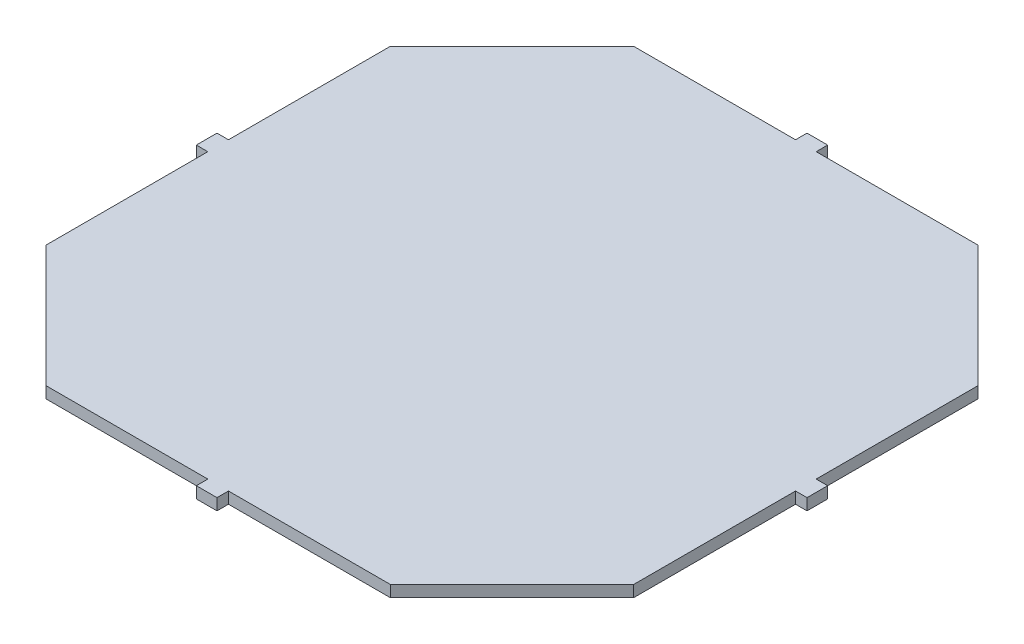
ISO-10303-21;
HEADER;
FILE_DESCRIPTION(('STEP AP214'),'2;1');
FILE_NAME('part.step','',(''),(''),'','','');
FILE_SCHEMA(('AUTOMOTIVE_DESIGN { 1 0 10303 214 1 1 1 1 }'));
ENDSEC;
DATA;
#1=APPLICATION_CONTEXT('core data for automotive mechanical design processes');
#2=APPLICATION_PROTOCOL_DEFINITION('international standard','automotive_design',2000,#1);
#3=PRODUCT_CONTEXT('',#1,'mechanical');
#4=PRODUCT('Part','Part','',(#3));
#5=PRODUCT_RELATED_PRODUCT_CATEGORY('part','',(#4));
#6=PRODUCT_DEFINITION_FORMATION('','',#4);
#7=PRODUCT_DEFINITION_CONTEXT('part definition',#1,'design');
#8=PRODUCT_DEFINITION('design','',#6,#7);
#9=PRODUCT_DEFINITION_SHAPE('','',#8);
#10=(LENGTH_UNIT() NAMED_UNIT(*) SI_UNIT(.MILLI.,.METRE.));
#11=(NAMED_UNIT(*) PLANE_ANGLE_UNIT() SI_UNIT($,.RADIAN.));
#12=(NAMED_UNIT(*) SI_UNIT($,.STERADIAN.) SOLID_ANGLE_UNIT());
#13=UNCERTAINTY_MEASURE_WITH_UNIT(LENGTH_MEASURE(1.E-05),#10,'distance_accuracy_value','');
#14=(GEOMETRIC_REPRESENTATION_CONTEXT(3) GLOBAL_UNCERTAINTY_ASSIGNED_CONTEXT((#13)) GLOBAL_UNIT_ASSIGNED_CONTEXT((#10,
#11,#12)) REPRESENTATION_CONTEXT('',''));
#15=CARTESIAN_POINT('',(0.,0.,0.));
#16=DIRECTION('',(0.,0.,1.));
#17=DIRECTION('',(1.,0.,0.));
#18=AXIS2_PLACEMENT_3D('',#15,#16,#17);
#19=CARTESIAN_POINT('',(25.6066017177982,1.,15.));
#20=DIRECTION('',(-1.,0.,0.));
#21=DIRECTION('',(0.,0.,1.));
#22=AXIS2_PLACEMENT_3D('',#19,#20,#21);
#23=PLANE('',#22);
#24=DIRECTION('',(0.,1.,0.));
#25=VECTOR('',#24,1.);
#26=CARTESIAN_POINT('',(25.6066017177982,0.,-0.899999999999994));
#27=LINE('',#26,#25);
#28=CARTESIAN_POINT('',(25.6066017177982,0.,-0.899999999999994));
#29=VERTEX_POINT('',#28);
#30=CARTESIAN_POINT('',(25.6066017177982,1.,-0.899999999999994));
#31=VERTEX_POINT('',#30);
#32=EDGE_CURVE('E212',#29,#31,#27,.T.);
#33=ORIENTED_EDGE('',*,*,#32,.F.);
#34=DIRECTION('',(0.,0.,-1.));
#35=VECTOR('',#34,1.);
#36=CARTESIAN_POINT('',(25.6066017177982,0.,15.));
#37=LINE('',#36,#35);
#38=CARTESIAN_POINT('',(25.6066017177982,0.,-15.));
#39=VERTEX_POINT('',#38);
#40=EDGE_CURVE('E224',#29,#39,#37,.T.);
#41=ORIENTED_EDGE('',*,*,#40,.T.);
#42=DIRECTION('',(0.,-1.,0.));
#43=VECTOR('',#42,1.);
#44=CARTESIAN_POINT('',(25.6066017177982,1.,-15.));
#45=LINE('',#44,#43);
#46=CARTESIAN_POINT('',(25.6066017177982,1.,-15.));
#47=VERTEX_POINT('',#46);
#48=EDGE_CURVE('E428',#47,#39,#45,.T.);
#49=ORIENTED_EDGE('',*,*,#48,.F.);
#50=DIRECTION('',(0.,0.,-1.));
#51=VECTOR('',#50,1.);
#52=CARTESIAN_POINT('',(25.6066017177982,1.,15.));
#53=LINE('',#52,#51);
#54=EDGE_CURVE('E370',#31,#47,#53,.T.);
#55=ORIENTED_EDGE('',*,*,#54,.F.);
#56=EDGE_LOOP('',(#33,#41,#49,#55));
#57=FACE_BOUND('',#56,.T.);
#58=ADVANCED_FACE('F39',(#57),#23,.F.);
#59=CARTESIAN_POINT('',(-15.,1.,25.6066017177983));
#60=DIRECTION('',(0.,0.,-1.));
#61=DIRECTION('',(-1.,0.,0.));
#62=AXIS2_PLACEMENT_3D('',#59,#60,#61);
#63=PLANE('',#62);
#64=DIRECTION('',(0.,1.,0.));
#65=VECTOR('',#64,1.);
#66=CARTESIAN_POINT('',(0.9,0.,25.6066017177983));
#67=LINE('',#66,#65);
#68=CARTESIAN_POINT('',(0.9,0.,25.6066017177983));
#69=VERTEX_POINT('',#68);
#70=CARTESIAN_POINT('',(0.9,1.,25.6066017177983));
#71=VERTEX_POINT('',#70);
#72=EDGE_CURVE('E277',#69,#71,#67,.T.);
#73=ORIENTED_EDGE('',*,*,#72,.F.);
#74=DIRECTION('',(1.,0.,0.));
#75=VECTOR('',#74,1.);
#76=CARTESIAN_POINT('',(-15.,0.,25.6066017177983));
#77=LINE('',#76,#75);
#78=CARTESIAN_POINT('',(15.,0.,25.6066017177983));
#79=VERTEX_POINT('',#78);
#80=EDGE_CURVE('E394',#69,#79,#77,.T.);
#81=ORIENTED_EDGE('',*,*,#80,.T.);
#82=DIRECTION('',(0.,-1.,0.));
#83=VECTOR('',#82,1.);
#84=CARTESIAN_POINT('',(15.,1.,25.6066017177983));
#85=LINE('',#84,#83);
#86=CARTESIAN_POINT('',(15.,1.,25.6066017177983));
#87=VERTEX_POINT('',#86);
#88=EDGE_CURVE('E436',#87,#79,#85,.T.);
#89=ORIENTED_EDGE('',*,*,#88,.F.);
#90=DIRECTION('',(1.,0.,0.));
#91=VECTOR('',#90,1.);
#92=CARTESIAN_POINT('',(-15.,1.,25.6066017177983));
#93=LINE('',#92,#91);
#94=EDGE_CURVE('E362',#71,#87,#93,.T.);
#95=ORIENTED_EDGE('',*,*,#94,.F.);
#96=EDGE_LOOP('',(#73,#81,#89,#95));
#97=FACE_BOUND('',#96,.T.);
#98=ADVANCED_FACE('F532',(#97),#63,.F.);
#99=CARTESIAN_POINT('',(-15.,1.,-25.6066017177983));
#100=DIRECTION('',(0.,0.,1.));
#101=DIRECTION('',(1.,0.,0.));
#102=AXIS2_PLACEMENT_3D('',#99,#100,#101);
#103=PLANE('',#102);
#104=DIRECTION('',(0.,1.,0.));
#105=VECTOR('',#104,1.);
#106=CARTESIAN_POINT('',(-0.9,0.,-25.6066017177983));
#107=LINE('',#106,#105);
#108=CARTESIAN_POINT('',(-0.9,0.,-25.6066017177983));
#109=VERTEX_POINT('',#108);
#110=CARTESIAN_POINT('',(-0.9,1.,-25.6066017177983));
#111=VERTEX_POINT('',#110);
#112=EDGE_CURVE('E305',#109,#111,#107,.T.);
#113=ORIENTED_EDGE('',*,*,#112,.F.);
#114=DIRECTION('',(-1.,0.,0.));
#115=VECTOR('',#114,1.);
#116=CARTESIAN_POINT('',(-15.,0.,-25.6066017177983));
#117=LINE('',#116,#115);
#118=CARTESIAN_POINT('',(-15.,0.,-25.6066017177983));
#119=VERTEX_POINT('',#118);
#120=EDGE_CURVE('E409',#109,#119,#117,.T.);
#121=ORIENTED_EDGE('',*,*,#120,.T.);
#122=DIRECTION('',(0.,-1.,0.));
#123=VECTOR('',#122,1.);
#124=CARTESIAN_POINT('',(-15.,1.,-25.6066017177983));
#125=LINE('',#124,#123);
#126=CARTESIAN_POINT('',(-15.,1.,-25.6066017177983));
#127=VERTEX_POINT('',#126);
#128=EDGE_CURVE('E420',#127,#119,#125,.T.);
#129=ORIENTED_EDGE('',*,*,#128,.F.);
#130=DIRECTION('',(-1.,0.,0.));
#131=VECTOR('',#130,1.);
#132=CARTESIAN_POINT('',(-15.,1.,-25.6066017177983));
#133=LINE('',#132,#131);
#134=EDGE_CURVE('E378',#111,#127,#133,.T.);
#135=ORIENTED_EDGE('',*,*,#134,.F.);
#136=EDGE_LOOP('',(#113,#121,#129,#135));
#137=FACE_BOUND('',#136,.T.);
#138=ADVANCED_FACE('F479',(#137),#103,.F.);
#139=CARTESIAN_POINT('',(-25.6066017177982,1.,15.));
#140=DIRECTION('',(1.,0.,0.));
#141=DIRECTION('',(0.,0.,-1.));
#142=AXIS2_PLACEMENT_3D('',#139,#140,#141);
#143=PLANE('',#142);
#144=DIRECTION('',(0.,1.,0.));
#145=VECTOR('',#144,1.);
#146=CARTESIAN_POINT('',(-25.6066017177982,0.,0.9));
#147=LINE('',#146,#145);
#148=CARTESIAN_POINT('',(-25.6066017177982,0.,0.9));
#149=VERTEX_POINT('',#148);
#150=CARTESIAN_POINT('',(-25.6066017177982,1.,0.9));
#151=VERTEX_POINT('',#150);
#152=EDGE_CURVE('E341',#149,#151,#147,.T.);
#153=ORIENTED_EDGE('',*,*,#152,.F.);
#154=DIRECTION('',(0.,0.,1.));
#155=VECTOR('',#154,1.);
#156=CARTESIAN_POINT('',(-25.6066017177982,0.,15.));
#157=LINE('',#156,#155);
#158=CARTESIAN_POINT('',(-25.6066017177982,0.,15.));
#159=VERTEX_POINT('',#158);
#160=EDGE_CURVE('E344',#149,#159,#157,.T.);
#161=ORIENTED_EDGE('',*,*,#160,.T.);
#162=DIRECTION('',(0.,-1.,0.));
#163=VECTOR('',#162,1.);
#164=CARTESIAN_POINT('',(-25.6066017177982,1.,15.));
#165=LINE('',#164,#163);
#166=CARTESIAN_POINT('',(-25.6066017177982,1.,15.));
#167=VERTEX_POINT('',#166);
#168=EDGE_CURVE('E11',#167,#159,#165,.T.);
#169=ORIENTED_EDGE('',*,*,#168,.F.);
#170=DIRECTION('',(0.,0.,1.));
#171=VECTOR('',#170,1.);
#172=CARTESIAN_POINT('',(-25.6066017177982,1.,15.));
#173=LINE('',#172,#171);
#174=EDGE_CURVE('E359',#151,#167,#173,.T.);
#175=ORIENTED_EDGE('',*,*,#174,.F.);
#176=EDGE_LOOP('',(#153,#161,#169,#175));
#177=FACE_BOUND('',#176,.T.);
#178=ADVANCED_FACE('F462',(#177),#143,.F.);
#179=CARTESIAN_POINT('',(-25.6066017177982,0.,-15.));
#180=VERTEX_POINT('',#179);
#181=CARTESIAN_POINT('',(-25.6066017177982,0.,-0.9));
#182=VERTEX_POINT('',#181);
#183=EDGE_CURVE('E387',#180,#182,#157,.T.);
#184=ORIENTED_EDGE('',*,*,#183,.T.);
#185=DIRECTION('',(0.,1.,0.));
#186=VECTOR('',#185,1.);
#187=CARTESIAN_POINT('',(-25.6066017177982,0.,-0.9));
#188=LINE('',#187,#186);
#189=CARTESIAN_POINT('',(-25.6066017177982,1.,-0.900000000000001));
#190=VERTEX_POINT('',#189);
#191=EDGE_CURVE('E330',#182,#190,#188,.T.);
#192=ORIENTED_EDGE('',*,*,#191,.T.);
#193=CARTESIAN_POINT('',(-25.6066017177982,1.,-15.));
#194=VERTEX_POINT('',#193);
#195=EDGE_CURVE('E354',#194,#190,#173,.T.);
#196=ORIENTED_EDGE('',*,*,#195,.F.);
#197=DIRECTION('',(0.,-1.,0.));
#198=VECTOR('',#197,1.);
#199=CARTESIAN_POINT('',(-25.6066017177982,1.,-15.));
#200=LINE('',#199,#198);
#201=EDGE_CURVE('E386',#194,#180,#200,.T.);
#202=ORIENTED_EDGE('',*,*,#201,.T.);
#203=EDGE_LOOP('',(#184,#192,#196,#202));
#204=FACE_BOUND('',#203,.T.);
#205=ADVANCED_FACE('F41',(#204),#143,.F.);
#206=CARTESIAN_POINT('',(-25.6066017177982,1.,15.));
#207=DIRECTION('',(0.70710678118655,0.,-0.707106781186545));
#208=DIRECTION('',(-0.707106781186545,0.,-0.70710678118655));
#209=AXIS2_PLACEMENT_3D('',#206,#207,#208);
#210=PLANE('',#209);
#211=DIRECTION('',(0.707106781186545,0.,0.70710678118655));
#212=VECTOR('',#211,1.);
#213=CARTESIAN_POINT('',(-25.6066017177982,0.,15.));
#214=LINE('',#213,#212);
#215=CARTESIAN_POINT('',(-15.,0.,25.6066017177983));
#216=VERTEX_POINT('',#215);
#217=EDGE_CURVE('E391',#159,#216,#214,.T.);
#218=ORIENTED_EDGE('',*,*,#217,.T.);
#219=DIRECTION('',(0.,-1.,0.));
#220=VECTOR('',#219,1.);
#221=CARTESIAN_POINT('',(-15.,1.,25.6066017177983));
#222=LINE('',#221,#220);
#223=CARTESIAN_POINT('',(-15.,1.,25.6066017177983));
#224=VERTEX_POINT('',#223);
#225=EDGE_CURVE('E48',#224,#216,#222,.T.);
#226=ORIENTED_EDGE('',*,*,#225,.F.);
#227=DIRECTION('',(0.707106781186545,0.,0.70710678118655));
#228=VECTOR('',#227,1.);
#229=CARTESIAN_POINT('',(-25.6066017177982,1.,15.));
#230=LINE('',#229,#228);
#231=EDGE_CURVE('E358',#167,#224,#230,.T.);
#232=ORIENTED_EDGE('',*,*,#231,.F.);
#233=ORIENTED_EDGE('',*,*,#168,.T.);
#234=EDGE_LOOP('',(#218,#226,#232,#233));
#235=FACE_BOUND('',#234,.T.);
#236=ADVANCED_FACE('F459',(#235),#210,.F.);
#237=CARTESIAN_POINT('',(-0.899999999999988,0.,25.6066017177983));
#238=VERTEX_POINT('',#237);
#239=EDGE_CURVE('E395',#216,#238,#77,.T.);
#240=ORIENTED_EDGE('',*,*,#239,.T.);
#241=DIRECTION('',(0.,1.,0.));
#242=VECTOR('',#241,1.);
#243=CARTESIAN_POINT('',(-0.899999999999988,0.,25.6066017177983));
#244=LINE('',#243,#242);
#245=CARTESIAN_POINT('',(-0.899999999999988,1.,25.6066017177983));
#246=VERTEX_POINT('',#245);
#247=EDGE_CURVE('E274',#238,#246,#244,.T.);
#248=ORIENTED_EDGE('',*,*,#247,.T.);
#249=EDGE_CURVE('E363',#224,#246,#93,.T.);
#250=ORIENTED_EDGE('',*,*,#249,.F.);
#251=ORIENTED_EDGE('',*,*,#225,.T.);
#252=EDGE_LOOP('',(#240,#248,#250,#251));
#253=FACE_BOUND('',#252,.T.);
#254=ADVANCED_FACE('F445',(#253),#63,.F.);
#255=CARTESIAN_POINT('',(15.,1.,25.6066017177983));
#256=DIRECTION('',(-0.707106781186548,0.,-0.707106781186547));
#257=DIRECTION('',(-0.707106781186547,0.,0.707106781186548));
#258=AXIS2_PLACEMENT_3D('',#255,#256,#257);
#259=PLANE('',#258);
#260=DIRECTION('',(0.707106781186547,0.,-0.707106781186548));
#261=VECTOR('',#260,1.);
#262=CARTESIAN_POINT('',(15.,0.,25.6066017177983));
#263=LINE('',#262,#261);
#264=CARTESIAN_POINT('',(25.6066017177982,0.,15.));
#265=VERTEX_POINT('',#264);
#266=EDGE_CURVE('E399',#79,#265,#263,.T.);
#267=ORIENTED_EDGE('',*,*,#266,.T.);
#268=DIRECTION('',(0.,-1.,0.));
#269=VECTOR('',#268,1.);
#270=CARTESIAN_POINT('',(25.6066017177982,1.,15.));
#271=LINE('',#270,#269);
#272=CARTESIAN_POINT('',(25.6066017177982,1.,15.));
#273=VERTEX_POINT('',#272);
#274=EDGE_CURVE('E432',#273,#265,#271,.T.);
#275=ORIENTED_EDGE('',*,*,#274,.F.);
#276=DIRECTION('',(0.707106781186547,0.,-0.707106781186548));
#277=VECTOR('',#276,1.);
#278=CARTESIAN_POINT('',(15.,1.,25.6066017177983));
#279=LINE('',#278,#277);
#280=EDGE_CURVE('E367',#87,#273,#279,.T.);
#281=ORIENTED_EDGE('',*,*,#280,.F.);
#282=ORIENTED_EDGE('',*,*,#88,.T.);
#283=EDGE_LOOP('',(#267,#275,#281,#282));
#284=FACE_BOUND('',#283,.T.);
#285=ADVANCED_FACE('F527',(#284),#259,.F.);
#286=CARTESIAN_POINT('',(25.6066017177982,0.,0.899999999999994));
#287=VERTEX_POINT('',#286);
#288=EDGE_CURVE('E402',#265,#287,#37,.T.);
#289=ORIENTED_EDGE('',*,*,#288,.T.);
#290=DIRECTION('',(0.,1.,0.));
#291=VECTOR('',#290,1.);
#292=CARTESIAN_POINT('',(25.6066017177982,0.,0.899999999999994));
#293=LINE('',#292,#291);
#294=CARTESIAN_POINT('',(25.6066017177982,1.,0.899999999999995));
#295=VERTEX_POINT('',#294);
#296=EDGE_CURVE('E244',#287,#295,#293,.T.);
#297=ORIENTED_EDGE('',*,*,#296,.T.);
#298=EDGE_CURVE('E371',#273,#295,#53,.T.);
#299=ORIENTED_EDGE('',*,*,#298,.F.);
#300=ORIENTED_EDGE('',*,*,#274,.T.);
#301=EDGE_LOOP('',(#289,#297,#299,#300));
#302=FACE_BOUND('',#301,.T.);
#303=ADVANCED_FACE('F521',(#302),#23,.F.);
#304=CARTESIAN_POINT('',(15.,1.,-25.6066017177983));
#305=DIRECTION('',(-0.70710678118655,0.,0.707106781186545));
#306=DIRECTION('',(0.707106781186545,0.,0.70710678118655));
#307=AXIS2_PLACEMENT_3D('',#304,#305,#306);
#308=PLANE('',#307);
#309=DIRECTION('',(-0.707106781186545,0.,-0.70710678118655));
#310=VECTOR('',#309,1.);
#311=CARTESIAN_POINT('',(15.,0.,-25.6066017177983));
#312=LINE('',#311,#310);
#313=CARTESIAN_POINT('',(15.,0.,-25.6066017177983));
#314=VERTEX_POINT('',#313);
#315=EDGE_CURVE('E406',#39,#314,#312,.T.);
#316=ORIENTED_EDGE('',*,*,#315,.T.);
#317=DIRECTION('',(0.,-1.,0.));
#318=VECTOR('',#317,1.);
#319=CARTESIAN_POINT('',(15.,1.,-25.6066017177983));
#320=LINE('',#319,#318);
#321=CARTESIAN_POINT('',(15.,1.,-25.6066017177983));
#322=VERTEX_POINT('',#321);
#323=EDGE_CURVE('E424',#322,#314,#320,.T.);
#324=ORIENTED_EDGE('',*,*,#323,.F.);
#325=DIRECTION('',(-0.707106781186545,0.,-0.70710678118655));
#326=VECTOR('',#325,1.);
#327=CARTESIAN_POINT('',(15.,1.,-25.6066017177983));
#328=LINE('',#327,#326);
#329=EDGE_CURVE('E375',#47,#322,#328,.T.);
#330=ORIENTED_EDGE('',*,*,#329,.F.);
#331=ORIENTED_EDGE('',*,*,#48,.T.);
#332=EDGE_LOOP('',(#316,#324,#330,#331));
#333=FACE_BOUND('',#332,.T.);
#334=ADVANCED_FACE('F513',(#333),#308,.F.);
#335=CARTESIAN_POINT('',(0.9,0.,-25.6066017177983));
#336=VERTEX_POINT('',#335);
#337=EDGE_CURVE('E410',#314,#336,#117,.T.);
#338=ORIENTED_EDGE('',*,*,#337,.T.);
#339=DIRECTION('',(0.,1.,0.));
#340=VECTOR('',#339,1.);
#341=CARTESIAN_POINT('',(0.9,0.,-25.6066017177983));
#342=LINE('',#341,#340);
#343=CARTESIAN_POINT('',(0.9,1.,-25.6066017177983));
#344=VERTEX_POINT('',#343);
#345=EDGE_CURVE('E294',#336,#344,#342,.T.);
#346=ORIENTED_EDGE('',*,*,#345,.T.);
#347=EDGE_CURVE('E379',#322,#344,#133,.T.);
#348=ORIENTED_EDGE('',*,*,#347,.F.);
#349=ORIENTED_EDGE('',*,*,#323,.T.);
#350=EDGE_LOOP('',(#338,#346,#348,#349));
#351=FACE_BOUND('',#350,.T.);
#352=ADVANCED_FACE('F508',(#351),#103,.F.);
#353=CARTESIAN_POINT('',(-25.6066017177982,1.,-15.));
#354=DIRECTION('',(0.707106781186552,0.,0.707106781186543));
#355=DIRECTION('',(0.707106781186543,0.,-0.707106781186552));
#356=AXIS2_PLACEMENT_3D('',#353,#354,#355);
#357=PLANE('',#356);
#358=DIRECTION('',(-0.707106781186543,0.,0.707106781186552));
#359=VECTOR('',#358,1.);
#360=CARTESIAN_POINT('',(-25.6066017177982,0.,-15.));
#361=LINE('',#360,#359);
#362=EDGE_CURVE('E414',#119,#180,#361,.T.);
#363=ORIENTED_EDGE('',*,*,#362,.T.);
#364=ORIENTED_EDGE('',*,*,#201,.F.);
#365=DIRECTION('',(-0.707106781186543,0.,0.707106781186552));
#366=VECTOR('',#365,1.);
#367=CARTESIAN_POINT('',(-25.6066017177982,1.,-15.));
#368=LINE('',#367,#366);
#369=EDGE_CURVE('E383',#127,#194,#368,.T.);
#370=ORIENTED_EDGE('',*,*,#369,.F.);
#371=ORIENTED_EDGE('',*,*,#128,.T.);
#372=EDGE_LOOP('',(#363,#364,#370,#371));
#373=FACE_BOUND('',#372,.T.);
#374=ADVANCED_FACE('F483',(#373),#357,.F.);
#375=CARTESIAN_POINT('',(0.,1.,0.));
#376=DIRECTION('',(0.,-1.,0.));
#377=DIRECTION('',(0.,0.,-1.));
#378=AXIS2_PLACEMENT_3D('',#375,#376,#377);
#379=PLANE('',#378);
#380=ORIENTED_EDGE('',*,*,#195,.T.);
#381=DIRECTION('',(-1.,0.,0.));
#382=VECTOR('',#381,1.);
#383=CARTESIAN_POINT('',(-25.6066017177982,1.,-0.9));
#384=LINE('',#383,#382);
#385=CARTESIAN_POINT('',(-26.6066017177982,1.,-0.9));
#386=VERTEX_POINT('',#385);
#387=EDGE_CURVE('E308',#190,#386,#384,.T.);
#388=ORIENTED_EDGE('',*,*,#387,.T.);
#389=DIRECTION('',(0.,0.,1.));
#390=VECTOR('',#389,1.);
#391=CARTESIAN_POINT('',(-26.6066017177982,1.,-0.9));
#392=LINE('',#391,#390);
#393=CARTESIAN_POINT('',(-26.6066017177982,1.,0.9));
#394=VERTEX_POINT('',#393);
#395=EDGE_CURVE('E334',#386,#394,#392,.T.);
#396=ORIENTED_EDGE('',*,*,#395,.T.);
#397=DIRECTION('',(1.,0.,0.));
#398=VECTOR('',#397,1.);
#399=CARTESIAN_POINT('',(-26.6066017177982,1.,0.9));
#400=LINE('',#399,#398);
#401=EDGE_CURVE('E323',#394,#151,#400,.T.);
#402=ORIENTED_EDGE('',*,*,#401,.T.);
#403=ORIENTED_EDGE('',*,*,#174,.T.);
#404=ORIENTED_EDGE('',*,*,#231,.T.);
#405=ORIENTED_EDGE('',*,*,#249,.T.);
#406=DIRECTION('',(0.,0.,1.));
#407=VECTOR('',#406,1.);
#408=CARTESIAN_POINT('',(-0.899999999999988,1.,25.6066017177983));
#409=LINE('',#408,#407);
#410=CARTESIAN_POINT('',(-0.899999999999987,1.,26.6066017177983));
#411=VERTEX_POINT('',#410);
#412=EDGE_CURVE('E63',#246,#411,#409,.T.);
#413=ORIENTED_EDGE('',*,*,#412,.T.);
#414=DIRECTION('',(1.,0.,0.));
#415=VECTOR('',#414,1.);
#416=CARTESIAN_POINT('',(-0.899999999999987,1.,26.6066017177983));
#417=LINE('',#416,#415);
#418=CARTESIAN_POINT('',(0.9,1.,26.6066017177983));
#419=VERTEX_POINT('',#418);
#420=EDGE_CURVE('E243',#411,#419,#417,.T.);
#421=ORIENTED_EDGE('',*,*,#420,.T.);
#422=DIRECTION('',(0.,0.,-1.));
#423=VECTOR('',#422,1.);
#424=CARTESIAN_POINT('',(0.9,1.,26.6066017177983));
#425=LINE('',#424,#423);
#426=EDGE_CURVE('E264',#419,#71,#425,.T.);
#427=ORIENTED_EDGE('',*,*,#426,.T.);
#428=ORIENTED_EDGE('',*,*,#94,.T.);
#429=ORIENTED_EDGE('',*,*,#280,.T.);
#430=ORIENTED_EDGE('',*,*,#298,.T.);
#431=DIRECTION('',(1.,0.,0.));
#432=VECTOR('',#431,1.);
#433=CARTESIAN_POINT('',(26.6066017177982,1.,0.899999999999993));
#434=LINE('',#433,#432);
#435=CARTESIAN_POINT('',(26.6066017177982,1.,0.899999999999993));
#436=VERTEX_POINT('',#435);
#437=EDGE_CURVE('E55',#295,#436,#434,.T.);
#438=ORIENTED_EDGE('',*,*,#437,.T.);
#439=DIRECTION('',(0.,0.,-1.));
#440=VECTOR('',#439,1.);
#441=CARTESIAN_POINT('',(26.6066017177982,1.,-0.899999999999993));
#442=LINE('',#441,#440);
#443=CARTESIAN_POINT('',(26.6066017177982,1.,-0.899999999999993));
#444=VERTEX_POINT('',#443);
#445=EDGE_CURVE('E236',#436,#444,#442,.T.);
#446=ORIENTED_EDGE('',*,*,#445,.T.);
#447=DIRECTION('',(-1.,0.,0.));
#448=VECTOR('',#447,1.);
#449=CARTESIAN_POINT('',(25.6066017177982,1.,-0.899999999999994));
#450=LINE('',#449,#448);
#451=EDGE_CURVE('E206',#444,#31,#450,.T.);
#452=ORIENTED_EDGE('',*,*,#451,.T.);
#453=ORIENTED_EDGE('',*,*,#54,.T.);
#454=ORIENTED_EDGE('',*,*,#329,.T.);
#455=ORIENTED_EDGE('',*,*,#347,.T.);
#456=DIRECTION('',(0.,0.,-1.));
#457=VECTOR('',#456,1.);
#458=CARTESIAN_POINT('',(0.9,1.,-26.6066017177983));
#459=LINE('',#458,#457);
#460=CARTESIAN_POINT('',(0.9,1.,-26.6066017177983));
#461=VERTEX_POINT('',#460);
#462=EDGE_CURVE('E273',#344,#461,#459,.T.);
#463=ORIENTED_EDGE('',*,*,#462,.T.);
#464=DIRECTION('',(-1.,0.,0.));
#465=VECTOR('',#464,1.);
#466=CARTESIAN_POINT('',(-0.9,1.,-26.6066017177983));
#467=LINE('',#466,#465);
#468=CARTESIAN_POINT('',(-0.9,1.,-26.6066017177983));
#469=VERTEX_POINT('',#468);
#470=EDGE_CURVE('E298',#461,#469,#467,.T.);
#471=ORIENTED_EDGE('',*,*,#470,.T.);
#472=DIRECTION('',(0.,0.,1.));
#473=VECTOR('',#472,1.);
#474=CARTESIAN_POINT('',(-0.9,1.,-25.6066017177983));
#475=LINE('',#474,#473);
#476=EDGE_CURVE('E287',#469,#111,#475,.T.);
#477=ORIENTED_EDGE('',*,*,#476,.T.);
#478=ORIENTED_EDGE('',*,*,#134,.T.);
#479=ORIENTED_EDGE('',*,*,#369,.T.);
#480=EDGE_LOOP('',(#380,#388,#396,#402,#403,#404,#405,#413,#421,#427,#428,#429,#430,#438,#446,
#452,#453,#454,#455,#463,#471,#477,#478,#479));
#481=FACE_BOUND('',#480,.T.);
#482=ADVANCED_FACE('F456',(#481),#379,.F.);
#483=CARTESIAN_POINT('',(0.,0.,0.));
#484=DIRECTION('',(0.,-1.,0.));
#485=DIRECTION('',(0.,0.,-1.));
#486=AXIS2_PLACEMENT_3D('',#483,#484,#485);
#487=PLANE('',#486);
#488=ORIENTED_EDGE('',*,*,#183,.F.);
#489=ORIENTED_EDGE('',*,*,#362,.F.);
#490=ORIENTED_EDGE('',*,*,#120,.F.);
#491=DIRECTION('',(0.,0.,1.));
#492=VECTOR('',#491,1.);
#493=CARTESIAN_POINT('',(-0.9,0.,-25.6066017177983));
#494=LINE('',#493,#492);
#495=CARTESIAN_POINT('',(-0.9,0.,-26.6066017177983));
#496=VERTEX_POINT('',#495);
#497=EDGE_CURVE('E291',#496,#109,#494,.T.);
#498=ORIENTED_EDGE('',*,*,#497,.F.);
#499=DIRECTION('',(-1.,0.,0.));
#500=VECTOR('',#499,1.);
#501=CARTESIAN_POINT('',(-0.9,0.,-26.6066017177983));
#502=LINE('',#501,#500);
#503=CARTESIAN_POINT('',(0.9,0.,-26.6066017177983));
#504=VERTEX_POINT('',#503);
#505=EDGE_CURVE('E286',#504,#496,#502,.T.);
#506=ORIENTED_EDGE('',*,*,#505,.F.);
#507=DIRECTION('',(0.,0.,-1.));
#508=VECTOR('',#507,1.);
#509=CARTESIAN_POINT('',(0.9,0.,-26.6066017177983));
#510=LINE('',#509,#508);
#511=EDGE_CURVE('E282',#336,#504,#510,.T.);
#512=ORIENTED_EDGE('',*,*,#511,.F.);
#513=ORIENTED_EDGE('',*,*,#337,.F.);
#514=ORIENTED_EDGE('',*,*,#315,.F.);
#515=ORIENTED_EDGE('',*,*,#40,.F.);
#516=DIRECTION('',(-1.,0.,0.));
#517=VECTOR('',#516,1.);
#518=CARTESIAN_POINT('',(25.6066017177982,0.,-0.899999999999994));
#519=LINE('',#518,#517);
#520=CARTESIAN_POINT('',(26.6066017177982,0.,-0.899999999999993));
#521=VERTEX_POINT('',#520);
#522=EDGE_CURVE('E203',#521,#29,#519,.T.);
#523=ORIENTED_EDGE('',*,*,#522,.F.);
#524=DIRECTION('',(0.,0.,-1.));
#525=VECTOR('',#524,1.);
#526=CARTESIAN_POINT('',(26.6066017177982,0.,-0.899999999999993));
#527=LINE('',#526,#525);
#528=CARTESIAN_POINT('',(26.6066017177982,0.,0.899999999999993));
#529=VERTEX_POINT('',#528);
#530=EDGE_CURVE('E221',#529,#521,#527,.T.);
#531=ORIENTED_EDGE('',*,*,#530,.F.);
#532=DIRECTION('',(1.,0.,0.));
#533=VECTOR('',#532,1.);
#534=CARTESIAN_POINT('',(26.6066017177982,0.,0.899999999999993));
#535=LINE('',#534,#533);
#536=EDGE_CURVE('E213',#287,#529,#535,.T.);
#537=ORIENTED_EDGE('',*,*,#536,.F.);
#538=ORIENTED_EDGE('',*,*,#288,.F.);
#539=ORIENTED_EDGE('',*,*,#266,.F.);
#540=ORIENTED_EDGE('',*,*,#80,.F.);
#541=DIRECTION('',(0.,0.,-1.));
#542=VECTOR('',#541,1.);
#543=CARTESIAN_POINT('',(0.9,0.,26.6066017177983));
#544=LINE('',#543,#542);
#545=CARTESIAN_POINT('',(0.9,0.,26.6066017177983));
#546=VERTEX_POINT('',#545);
#547=EDGE_CURVE('E253',#546,#69,#544,.T.);
#548=ORIENTED_EDGE('',*,*,#547,.F.);
#549=DIRECTION('',(1.,0.,0.));
#550=VECTOR('',#549,1.);
#551=CARTESIAN_POINT('',(-0.899999999999987,0.,26.6066017177983));
#552=LINE('',#551,#550);
#553=CARTESIAN_POINT('',(-0.899999999999987,0.,26.6066017177983));
#554=VERTEX_POINT('',#553);
#555=EDGE_CURVE('E249',#554,#546,#552,.T.);
#556=ORIENTED_EDGE('',*,*,#555,.F.);
#557=DIRECTION('',(0.,0.,1.));
#558=VECTOR('',#557,1.);
#559=CARTESIAN_POINT('',(-0.899999999999988,0.,25.6066017177983));
#560=LINE('',#559,#558);
#561=EDGE_CURVE('E256',#238,#554,#560,.T.);
#562=ORIENTED_EDGE('',*,*,#561,.F.);
#563=ORIENTED_EDGE('',*,*,#239,.F.);
#564=ORIENTED_EDGE('',*,*,#217,.F.);
#565=ORIENTED_EDGE('',*,*,#160,.F.);
#566=DIRECTION('',(1.,0.,0.));
#567=VECTOR('',#566,1.);
#568=CARTESIAN_POINT('',(-26.6066017177982,0.,0.9));
#569=LINE('',#568,#567);
#570=CARTESIAN_POINT('',(-26.6066017177982,0.,0.9));
#571=VERTEX_POINT('',#570);
#572=EDGE_CURVE('E327',#571,#149,#569,.T.);
#573=ORIENTED_EDGE('',*,*,#572,.F.);
#574=DIRECTION('',(0.,0.,1.));
#575=VECTOR('',#574,1.);
#576=CARTESIAN_POINT('',(-26.6066017177982,0.,-0.9));
#577=LINE('',#576,#575);
#578=CARTESIAN_POINT('',(-26.6066017177982,0.,-0.9));
#579=VERTEX_POINT('',#578);
#580=EDGE_CURVE('E322',#579,#571,#577,.T.);
#581=ORIENTED_EDGE('',*,*,#580,.F.);
#582=DIRECTION('',(-1.,0.,0.));
#583=VECTOR('',#582,1.);
#584=CARTESIAN_POINT('',(-25.6066017177982,0.,-0.9));
#585=LINE('',#584,#583);
#586=EDGE_CURVE('E318',#182,#579,#585,.T.);
#587=ORIENTED_EDGE('',*,*,#586,.F.);
#588=EDGE_LOOP('',(#488,#489,#490,#498,#506,#512,#513,#514,#515,#523,#531,#537,#538,#539,#540,
#548,#556,#562,#563,#564,#565,#573,#581,#587));
#589=FACE_BOUND('',#588,.T.);
#590=ADVANCED_FACE('F219',(#589),#487,.T.);
#591=CARTESIAN_POINT('',(-26.6066017177982,0.,0.9));
#592=DIRECTION('',(0.,0.,1.));
#593=DIRECTION('',(1.,0.,0.));
#594=AXIS2_PLACEMENT_3D('',#591,#592,#593);
#595=PLANE('',#594);
#596=ORIENTED_EDGE('',*,*,#401,.F.);
#597=DIRECTION('',(0.,1.,0.));
#598=VECTOR('',#597,1.);
#599=CARTESIAN_POINT('',(-26.6066017177982,0.,0.9));
#600=LINE('',#599,#598);
#601=EDGE_CURVE('E345',#571,#394,#600,.T.);
#602=ORIENTED_EDGE('',*,*,#601,.F.);
#603=ORIENTED_EDGE('',*,*,#572,.T.);
#604=ORIENTED_EDGE('',*,*,#152,.T.);
#605=EDGE_LOOP('',(#596,#602,#603,#604));
#606=FACE_BOUND('',#605,.T.);
#607=ADVANCED_FACE('F495',(#606),#595,.T.);
#608=CARTESIAN_POINT('',(-26.6066017177982,0.,-0.9));
#609=DIRECTION('',(-1.,0.,0.));
#610=DIRECTION('',(0.,0.,1.));
#611=AXIS2_PLACEMENT_3D('',#608,#609,#610);
#612=PLANE('',#611);
#613=ORIENTED_EDGE('',*,*,#395,.F.);
#614=DIRECTION('',(0.,1.,0.));
#615=VECTOR('',#614,1.);
#616=CARTESIAN_POINT('',(-26.6066017177982,0.,-0.9));
#617=LINE('',#616,#615);
#618=EDGE_CURVE('E348',#579,#386,#617,.T.);
#619=ORIENTED_EDGE('',*,*,#618,.F.);
#620=ORIENTED_EDGE('',*,*,#580,.T.);
#621=ORIENTED_EDGE('',*,*,#601,.T.);
#622=EDGE_LOOP('',(#613,#619,#620,#621));
#623=FACE_BOUND('',#622,.T.);
#624=ADVANCED_FACE('F493',(#623),#612,.T.);
#625=CARTESIAN_POINT('',(-25.6066017177982,0.,-0.9));
#626=DIRECTION('',(0.,0.,-1.));
#627=DIRECTION('',(-1.,0.,0.));
#628=AXIS2_PLACEMENT_3D('',#625,#626,#627);
#629=PLANE('',#628);
#630=ORIENTED_EDGE('',*,*,#387,.F.);
#631=ORIENTED_EDGE('',*,*,#191,.F.);
#632=ORIENTED_EDGE('',*,*,#586,.T.);
#633=ORIENTED_EDGE('',*,*,#618,.T.);
#634=EDGE_LOOP('',(#630,#631,#632,#633));
#635=FACE_BOUND('',#634,.T.);
#636=ADVANCED_FACE('F489',(#635),#629,.T.);
#637=CARTESIAN_POINT('',(-0.9,0.,-25.6066017177983));
#638=DIRECTION('',(-1.,0.,0.));
#639=DIRECTION('',(0.,0.,1.));
#640=AXIS2_PLACEMENT_3D('',#637,#638,#639);
#641=PLANE('',#640);
#642=ORIENTED_EDGE('',*,*,#476,.F.);
#643=DIRECTION('',(0.,1.,0.));
#644=VECTOR('',#643,1.);
#645=CARTESIAN_POINT('',(-0.9,0.,-26.6066017177983));
#646=LINE('',#645,#644);
#647=EDGE_CURVE('E309',#496,#469,#646,.T.);
#648=ORIENTED_EDGE('',*,*,#647,.F.);
#649=ORIENTED_EDGE('',*,*,#497,.T.);
#650=ORIENTED_EDGE('',*,*,#112,.T.);
#651=EDGE_LOOP('',(#642,#648,#649,#650));
#652=FACE_BOUND('',#651,.T.);
#653=ADVANCED_FACE('F500',(#652),#641,.T.);
#654=CARTESIAN_POINT('',(-0.9,0.,-26.6066017177983));
#655=DIRECTION('',(0.,0.,-1.));
#656=DIRECTION('',(-1.,0.,0.));
#657=AXIS2_PLACEMENT_3D('',#654,#655,#656);
#658=PLANE('',#657);
#659=ORIENTED_EDGE('',*,*,#470,.F.);
#660=DIRECTION('',(0.,1.,0.));
#661=VECTOR('',#660,1.);
#662=CARTESIAN_POINT('',(0.9,0.,-26.6066017177983));
#663=LINE('',#662,#661);
#664=EDGE_CURVE('E312',#504,#461,#663,.T.);
#665=ORIENTED_EDGE('',*,*,#664,.F.);
#666=ORIENTED_EDGE('',*,*,#505,.T.);
#667=ORIENTED_EDGE('',*,*,#647,.T.);
#668=EDGE_LOOP('',(#659,#665,#666,#667));
#669=FACE_BOUND('',#668,.T.);
#670=ADVANCED_FACE('F503',(#669),#658,.T.);
#671=CARTESIAN_POINT('',(0.9,0.,-26.6066017177983));
#672=DIRECTION('',(1.,0.,0.));
#673=DIRECTION('',(0.,0.,-1.));
#674=AXIS2_PLACEMENT_3D('',#671,#672,#673);
#675=PLANE('',#674);
#676=ORIENTED_EDGE('',*,*,#462,.F.);
#677=ORIENTED_EDGE('',*,*,#345,.F.);
#678=ORIENTED_EDGE('',*,*,#511,.T.);
#679=ORIENTED_EDGE('',*,*,#664,.T.);
#680=EDGE_LOOP('',(#676,#677,#678,#679));
#681=FACE_BOUND('',#680,.T.);
#682=ADVANCED_FACE('F505',(#681),#675,.T.);
#683=CARTESIAN_POINT('',(-0.899999999999987,0.,26.6066017177983));
#684=DIRECTION('',(0.,0.,1.));
#685=DIRECTION('',(1.,0.,0.));
#686=AXIS2_PLACEMENT_3D('',#683,#684,#685);
#687=PLANE('',#686);
#688=ORIENTED_EDGE('',*,*,#420,.F.);
#689=DIRECTION('',(0.,1.,0.));
#690=VECTOR('',#689,1.);
#691=CARTESIAN_POINT('',(-0.899999999999987,0.,26.6066017177983));
#692=LINE('',#691,#690);
#693=EDGE_CURVE('E270',#554,#411,#692,.T.);
#694=ORIENTED_EDGE('',*,*,#693,.F.);
#695=ORIENTED_EDGE('',*,*,#555,.T.);
#696=DIRECTION('',(0.,1.,0.));
#697=VECTOR('',#696,1.);
#698=CARTESIAN_POINT('',(0.9,0.,26.6066017177983));
#699=LINE('',#698,#697);
#700=EDGE_CURVE('E260',#546,#419,#699,.T.);
#701=ORIENTED_EDGE('',*,*,#700,.T.);
#702=EDGE_LOOP('',(#688,#694,#695,#701));
#703=FACE_BOUND('',#702,.T.);
#704=ADVANCED_FACE('F537',(#703),#687,.T.);
#705=CARTESIAN_POINT('',(-0.899999999999988,0.,25.6066017177983));
#706=DIRECTION('',(-1.,0.,0.));
#707=DIRECTION('',(0.,0.,1.));
#708=AXIS2_PLACEMENT_3D('',#705,#706,#707);
#709=PLANE('',#708);
#710=ORIENTED_EDGE('',*,*,#412,.F.);
#711=ORIENTED_EDGE('',*,*,#247,.F.);
#712=ORIENTED_EDGE('',*,*,#561,.T.);
#713=ORIENTED_EDGE('',*,*,#693,.T.);
#714=EDGE_LOOP('',(#710,#711,#712,#713));
#715=FACE_BOUND('',#714,.T.);
#716=ADVANCED_FACE('F453',(#715),#709,.T.);
#717=CARTESIAN_POINT('',(0.9,0.,26.6066017177983));
#718=DIRECTION('',(1.,0.,0.));
#719=DIRECTION('',(0.,0.,-1.));
#720=AXIS2_PLACEMENT_3D('',#717,#718,#719);
#721=PLANE('',#720);
#722=ORIENTED_EDGE('',*,*,#426,.F.);
#723=ORIENTED_EDGE('',*,*,#700,.F.);
#724=ORIENTED_EDGE('',*,*,#547,.T.);
#725=ORIENTED_EDGE('',*,*,#72,.T.);
#726=EDGE_LOOP('',(#722,#723,#724,#725));
#727=FACE_BOUND('',#726,.T.);
#728=ADVANCED_FACE('F535',(#727),#721,.T.);
#729=CARTESIAN_POINT('',(26.6066017177982,0.,-0.899999999999993));
#730=DIRECTION('',(1.,0.,0.));
#731=DIRECTION('',(0.,0.,-1.));
#732=AXIS2_PLACEMENT_3D('',#729,#730,#731);
#733=PLANE('',#732);
#734=ORIENTED_EDGE('',*,*,#445,.F.);
#735=DIRECTION('',(0.,1.,0.));
#736=VECTOR('',#735,1.);
#737=CARTESIAN_POINT('',(26.6066017177982,0.,0.899999999999993));
#738=LINE('',#737,#736);
#739=EDGE_CURVE('E228',#529,#436,#738,.T.);
#740=ORIENTED_EDGE('',*,*,#739,.F.);
#741=ORIENTED_EDGE('',*,*,#530,.T.);
#742=DIRECTION('',(0.,1.,0.));
#743=VECTOR('',#742,1.);
#744=CARTESIAN_POINT('',(26.6066017177982,0.,-0.899999999999993));
#745=LINE('',#744,#743);
#746=EDGE_CURVE('E200',#521,#444,#745,.T.);
#747=ORIENTED_EDGE('',*,*,#746,.T.);
#748=EDGE_LOOP('',(#734,#740,#741,#747));
#749=FACE_BOUND('',#748,.T.);
#750=ADVANCED_FACE('F227',(#749),#733,.T.);
#751=CARTESIAN_POINT('',(26.6066017177982,0.,0.899999999999993));
#752=DIRECTION('',(0.,0.,1.));
#753=DIRECTION('',(1.,0.,0.));
#754=AXIS2_PLACEMENT_3D('',#751,#752,#753);
#755=PLANE('',#754);
#756=ORIENTED_EDGE('',*,*,#437,.F.);
#757=ORIENTED_EDGE('',*,*,#296,.F.);
#758=ORIENTED_EDGE('',*,*,#536,.T.);
#759=ORIENTED_EDGE('',*,*,#739,.T.);
#760=EDGE_LOOP('',(#756,#757,#758,#759));
#761=FACE_BOUND('',#760,.T.);
#762=ADVANCED_FACE('F523',(#761),#755,.T.);
#763=CARTESIAN_POINT('',(25.6066017177982,0.,-0.899999999999994));
#764=DIRECTION('',(0.,0.,-1.));
#765=DIRECTION('',(-1.,0.,0.));
#766=AXIS2_PLACEMENT_3D('',#763,#764,#765);
#767=PLANE('',#766);
#768=ORIENTED_EDGE('',*,*,#451,.F.);
#769=ORIENTED_EDGE('',*,*,#746,.F.);
#770=ORIENTED_EDGE('',*,*,#522,.T.);
#771=ORIENTED_EDGE('',*,*,#32,.T.);
#772=EDGE_LOOP('',(#768,#769,#770,#771));
#773=FACE_BOUND('',#772,.T.);
#774=ADVANCED_FACE('F202',(#773),#767,.T.);
#775=CLOSED_SHELL('',(#58,#98,#138,#178,#205,#236,#254,#285,#303,#334,#352,#374,#482,#590,#607,
#624,#636,#653,#670,#682,#704,#716,#728,#750,#762,#774));
#776=MANIFOLD_SOLID_BREP('B2',#775);
#777=ADVANCED_BREP_SHAPE_REPRESENTATION('',(#18,#776),#14);
#778=SHAPE_DEFINITION_REPRESENTATION(#9,#777);
ENDSEC;
END-ISO-10303-21;
